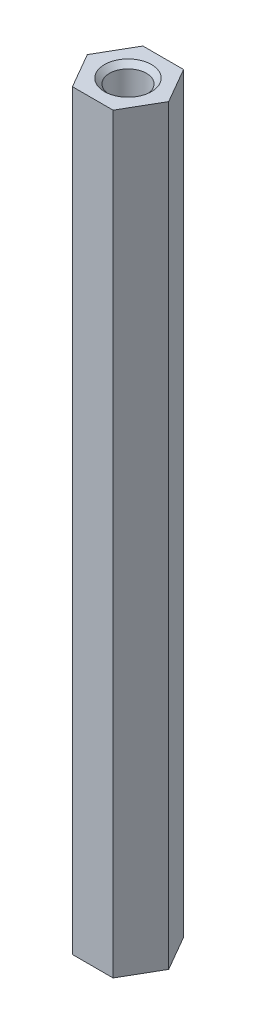
ISO-10303-21;
HEADER;
FILE_DESCRIPTION(('STEP AP214'),'2;1');
FILE_NAME('part.step','',(''),(''),'','','');
FILE_SCHEMA(('AUTOMOTIVE_DESIGN { 1 0 10303 214 1 1 1 1 }'));
ENDSEC;
DATA;
#1=APPLICATION_CONTEXT('core data for automotive mechanical design processes');
#2=APPLICATION_PROTOCOL_DEFINITION('international standard','automotive_design',2000,#1);
#3=PRODUCT_CONTEXT('',#1,'mechanical');
#4=PRODUCT('Part','Part','',(#3));
#5=PRODUCT_RELATED_PRODUCT_CATEGORY('part','',(#4));
#6=PRODUCT_DEFINITION_FORMATION('','',#4);
#7=PRODUCT_DEFINITION_CONTEXT('part definition',#1,'design');
#8=PRODUCT_DEFINITION('design','',#6,#7);
#9=PRODUCT_DEFINITION_SHAPE('','',#8);
#10=(LENGTH_UNIT() NAMED_UNIT(*) SI_UNIT(.MILLI.,.METRE.));
#11=(NAMED_UNIT(*) PLANE_ANGLE_UNIT() SI_UNIT($,.RADIAN.));
#12=(NAMED_UNIT(*) SI_UNIT($,.STERADIAN.) SOLID_ANGLE_UNIT());
#13=UNCERTAINTY_MEASURE_WITH_UNIT(LENGTH_MEASURE(1.E-05),#10,'distance_accuracy_value','');
#14=(GEOMETRIC_REPRESENTATION_CONTEXT(3) GLOBAL_UNCERTAINTY_ASSIGNED_CONTEXT((#13)) GLOBAL_UNIT_ASSIGNED_CONTEXT((#10,
#11,#12)) REPRESENTATION_CONTEXT('',''));
#15=CARTESIAN_POINT('',(0.,0.,0.));
#16=DIRECTION('',(0.,0.,1.));
#17=DIRECTION('',(1.,0.,0.));
#18=AXIS2_PLACEMENT_3D('',#15,#16,#17);
#19=CARTESIAN_POINT('',(0.866025403784438,32.,-1.5));
#20=DIRECTION('',(0.,0.,1.));
#21=DIRECTION('',(1.,0.,0.));
#22=AXIS2_PLACEMENT_3D('',#19,#20,#21);
#23=PLANE('',#22);
#24=DIRECTION('',(0.,1.,0.));
#25=VECTOR('',#24,1.);
#26=CARTESIAN_POINT('',(-0.866025403784439,32.,-1.5));
#27=LINE('',#26,#25);
#28=CARTESIAN_POINT('',(-0.866025403784438,0.,-1.5));
#29=VERTEX_POINT('',#28);
#30=CARTESIAN_POINT('',(-0.866025403784438,32.,-1.5));
#31=VERTEX_POINT('',#30);
#32=EDGE_CURVE('E83',#29,#31,#27,.T.);
#33=ORIENTED_EDGE('',*,*,#32,.T.);
#34=DIRECTION('',(1.,0.,0.));
#35=VECTOR('',#34,1.);
#36=CARTESIAN_POINT('',(0.866025403784438,32.,-1.5));
#37=LINE('',#36,#35);
#38=CARTESIAN_POINT('',(0.866025403784438,32.,-1.5));
#39=VERTEX_POINT('',#38);
#40=EDGE_CURVE('E71',#39,#31,#37,.F.);
#41=ORIENTED_EDGE('',*,*,#40,.F.);
#42=DIRECTION('',(0.,1.,0.));
#43=VECTOR('',#42,1.);
#44=CARTESIAN_POINT('',(0.866025403784438,32.,-1.5));
#45=LINE('',#44,#43);
#46=CARTESIAN_POINT('',(0.866025403784438,0.,-1.5));
#47=VERTEX_POINT('',#46);
#48=EDGE_CURVE('E126',#39,#47,#45,.F.);
#49=ORIENTED_EDGE('',*,*,#48,.T.);
#50=DIRECTION('',(1.,0.,0.));
#51=VECTOR('',#50,1.);
#52=CARTESIAN_POINT('',(0.866025403784438,0.,-1.5));
#53=LINE('',#52,#51);
#54=EDGE_CURVE('E67',#29,#47,#53,.T.);
#55=ORIENTED_EDGE('',*,*,#54,.F.);
#56=EDGE_LOOP('',(#33,#41,#49,#55));
#57=FACE_BOUND('',#56,.T.);
#58=ADVANCED_FACE('F17',(#57),#23,.F.);
#59=CARTESIAN_POINT('',(-0.866025403784439,32.,-1.5));
#60=DIRECTION('',(0.866025403784439,0.,0.5));
#61=DIRECTION('',(0.5,0.,-0.866025403784439));
#62=AXIS2_PLACEMENT_3D('',#59,#60,#61);
#63=PLANE('',#62);
#64=DIRECTION('',(0.,1.,0.));
#65=VECTOR('',#64,1.);
#66=CARTESIAN_POINT('',(-1.73205080756888,32.,0.));
#67=LINE('',#66,#65);
#68=CARTESIAN_POINT('',(-1.73205080756888,0.,0.));
#69=VERTEX_POINT('',#68);
#70=CARTESIAN_POINT('',(-1.73205080756888,32.,0.));
#71=VERTEX_POINT('',#70);
#72=EDGE_CURVE('E86',#69,#71,#67,.T.);
#73=ORIENTED_EDGE('',*,*,#72,.T.);
#74=DIRECTION('',(0.5,0.,-0.866025403784439));
#75=VECTOR('',#74,1.);
#76=CARTESIAN_POINT('',(-0.866025403784439,32.,-1.5));
#77=LINE('',#76,#75);
#78=EDGE_CURVE('E75',#31,#71,#77,.F.);
#79=ORIENTED_EDGE('',*,*,#78,.F.);
#80=ORIENTED_EDGE('',*,*,#32,.F.);
#81=DIRECTION('',(0.5,0.,-0.866025403784439));
#82=VECTOR('',#81,1.);
#83=CARTESIAN_POINT('',(-0.866025403784439,0.,-1.5));
#84=LINE('',#83,#82);
#85=EDGE_CURVE('E87',#69,#29,#84,.T.);
#86=ORIENTED_EDGE('',*,*,#85,.F.);
#87=EDGE_LOOP('',(#73,#79,#80,#86));
#88=FACE_BOUND('',#87,.T.);
#89=ADVANCED_FACE('F82',(#88),#63,.F.);
#90=CARTESIAN_POINT('',(1.7320508075689,32.,0.));
#91=DIRECTION('',(-0.866025403784434,0.,0.500000000000008));
#92=DIRECTION('',(0.500000000000008,0.,0.866025403784434));
#93=AXIS2_PLACEMENT_3D('',#90,#91,#92);
#94=PLANE('',#93);
#95=ORIENTED_EDGE('',*,*,#48,.F.);
#96=DIRECTION('',(0.500000000000008,0.,0.866025403784434));
#97=VECTOR('',#96,1.);
#98=CARTESIAN_POINT('',(1.7320508075689,32.,0.));
#99=LINE('',#98,#97);
#100=CARTESIAN_POINT('',(1.7320508075689,32.,0.));
#101=VERTEX_POINT('',#100);
#102=EDGE_CURVE('E77',#101,#39,#99,.F.);
#103=ORIENTED_EDGE('',*,*,#102,.F.);
#104=DIRECTION('',(0.,1.,0.));
#105=VECTOR('',#104,1.);
#106=CARTESIAN_POINT('',(1.7320508075689,32.,0.));
#107=LINE('',#106,#105);
#108=CARTESIAN_POINT('',(1.7320508075689,0.,0.));
#109=VERTEX_POINT('',#108);
#110=EDGE_CURVE('E113',#101,#109,#107,.F.);
#111=ORIENTED_EDGE('',*,*,#110,.T.);
#112=DIRECTION('',(0.500000000000008,0.,0.866025403784434));
#113=VECTOR('',#112,1.);
#114=CARTESIAN_POINT('',(1.7320508075689,0.,0.));
#115=LINE('',#114,#113);
#116=EDGE_CURVE('E124',#47,#109,#115,.T.);
#117=ORIENTED_EDGE('',*,*,#116,.F.);
#118=EDGE_LOOP('',(#95,#103,#111,#117));
#119=FACE_BOUND('',#118,.T.);
#120=ADVANCED_FACE('F143',(#119),#94,.F.);
#121=CARTESIAN_POINT('',(-1.73205080756888,32.,0.));
#122=DIRECTION('',(0.866025403784439,0.,-0.5));
#123=DIRECTION('',(-0.5,0.,-0.866025403784439));
#124=AXIS2_PLACEMENT_3D('',#121,#122,#123);
#125=PLANE('',#124);
#126=DIRECTION('',(0.,1.,0.));
#127=VECTOR('',#126,1.);
#128=CARTESIAN_POINT('',(-0.866025403784439,32.,1.5));
#129=LINE('',#128,#127);
#130=CARTESIAN_POINT('',(-0.866025403784439,0.,1.5));
#131=VERTEX_POINT('',#130);
#132=CARTESIAN_POINT('',(-0.866025403784439,32.,1.5));
#133=VERTEX_POINT('',#132);
#134=EDGE_CURVE('E112',#131,#133,#129,.T.);
#135=ORIENTED_EDGE('',*,*,#134,.T.);
#136=DIRECTION('',(-0.5,0.,-0.866025403784439));
#137=VECTOR('',#136,1.);
#138=CARTESIAN_POINT('',(-1.73205080756888,32.,0.));
#139=LINE('',#138,#137);
#140=EDGE_CURVE('E35',#71,#133,#139,.F.);
#141=ORIENTED_EDGE('',*,*,#140,.F.);
#142=ORIENTED_EDGE('',*,*,#72,.F.);
#143=DIRECTION('',(-0.5,0.,-0.866025403784439));
#144=VECTOR('',#143,1.);
#145=CARTESIAN_POINT('',(-1.73205080756888,0.,0.));
#146=LINE('',#145,#144);
#147=EDGE_CURVE('E119',#131,#69,#146,.T.);
#148=ORIENTED_EDGE('',*,*,#147,.F.);
#149=EDGE_LOOP('',(#135,#141,#142,#148));
#150=FACE_BOUND('',#149,.T.);
#151=ADVANCED_FACE('F133',(#150),#125,.F.);
#152=CARTESIAN_POINT('',(0.866025403784439,32.,1.5));
#153=DIRECTION('',(-0.866025403784432,0.,-0.500000000000011));
#154=DIRECTION('',(-0.500000000000011,0.,0.866025403784432));
#155=AXIS2_PLACEMENT_3D('',#152,#153,#154);
#156=PLANE('',#155);
#157=ORIENTED_EDGE('',*,*,#110,.F.);
#158=DIRECTION('',(-0.500000000000011,0.,0.866025403784432));
#159=VECTOR('',#158,1.);
#160=CARTESIAN_POINT('',(0.866025403784439,32.,1.5));
#161=LINE('',#160,#159);
#162=CARTESIAN_POINT('',(0.866025403784439,32.,1.5));
#163=VERTEX_POINT('',#162);
#164=EDGE_CURVE('E117',#163,#101,#161,.F.);
#165=ORIENTED_EDGE('',*,*,#164,.F.);
#166=DIRECTION('',(0.,1.,0.));
#167=VECTOR('',#166,1.);
#168=CARTESIAN_POINT('',(0.866025403784439,32.,1.5));
#169=LINE('',#168,#167);
#170=CARTESIAN_POINT('',(0.866025403784439,0.,1.5));
#171=VERTEX_POINT('',#170);
#172=EDGE_CURVE('E109',#163,#171,#169,.F.);
#173=ORIENTED_EDGE('',*,*,#172,.T.);
#174=DIRECTION('',(0.500000000000011,0.,-0.866025403784432));
#175=VECTOR('',#174,1.);
#176=CARTESIAN_POINT('',(0.866025403784439,0.,1.5));
#177=LINE('',#176,#175);
#178=EDGE_CURVE('E101',#171,#109,#177,.T.);
#179=ORIENTED_EDGE('',*,*,#178,.T.);
#180=EDGE_LOOP('',(#157,#165,#173,#179));
#181=FACE_BOUND('',#180,.T.);
#182=ADVANCED_FACE('F141',(#181),#156,.F.);
#183=CARTESIAN_POINT('',(-0.866025403784439,32.,1.5));
#184=DIRECTION('',(0.,0.,-1.));
#185=DIRECTION('',(-1.,0.,0.));
#186=AXIS2_PLACEMENT_3D('',#183,#184,#185);
#187=PLANE('',#186);
#188=ORIENTED_EDGE('',*,*,#172,.F.);
#189=DIRECTION('',(1.,0.,0.));
#190=VECTOR('',#189,1.);
#191=CARTESIAN_POINT('',(0.,32.,1.5));
#192=LINE('',#191,#190);
#193=EDGE_CURVE('E98',#133,#163,#192,.T.);
#194=ORIENTED_EDGE('',*,*,#193,.F.);
#195=ORIENTED_EDGE('',*,*,#134,.F.);
#196=DIRECTION('',(1.,0.,0.));
#197=VECTOR('',#196,1.);
#198=CARTESIAN_POINT('',(0.,0.,1.5));
#199=LINE('',#198,#197);
#200=EDGE_CURVE('E105',#131,#171,#199,.T.);
#201=ORIENTED_EDGE('',*,*,#200,.T.);
#202=EDGE_LOOP('',(#188,#194,#195,#201));
#203=FACE_BOUND('',#202,.T.);
#204=ADVANCED_FACE('F137',(#203),#187,.F.);
#205=CARTESIAN_POINT('',(0.,0.,0.));
#206=DIRECTION('',(0.,1.,0.));
#207=DIRECTION('',(0.,0.,1.));
#208=AXIS2_PLACEMENT_3D('',#205,#206,#207);
#209=PLANE('',#208);
#210=ORIENTED_EDGE('',*,*,#200,.F.);
#211=ORIENTED_EDGE('',*,*,#147,.T.);
#212=ORIENTED_EDGE('',*,*,#85,.T.);
#213=ORIENTED_EDGE('',*,*,#54,.T.);
#214=ORIENTED_EDGE('',*,*,#116,.T.);
#215=ORIENTED_EDGE('',*,*,#178,.F.);
#216=EDGE_LOOP('',(#210,#211,#212,#213,#214,#215));
#217=FACE_BOUND('',#216,.T.);
#218=CARTESIAN_POINT('',(0.,0.,0.));
#219=DIRECTION('',(0.,-1.,0.));
#220=DIRECTION('',(0.,0.,-1.));
#221=AXIS2_PLACEMENT_3D('',#218,#219,#220);
#222=CIRCLE('',#221,1.0000000000332);
#223=CARTESIAN_POINT('',(0.,0.,-1.0000000000332));
#224=VERTEX_POINT('',#223);
#225=EDGE_CURVE('E20',#224,#224,#222,.F.);
#226=ORIENTED_EDGE('',*,*,#225,.T.);
#227=EDGE_LOOP('',(#226));
#228=FACE_BOUND('',#227,.T.);
#229=ADVANCED_FACE('F130',(#217,#228),#209,.F.);
#230=CARTESIAN_POINT('',(0.,32.,0.));
#231=DIRECTION('',(0.,1.,0.));
#232=DIRECTION('',(0.,0.,1.));
#233=AXIS2_PLACEMENT_3D('',#230,#231,#232);
#234=PLANE('',#233);
#235=ORIENTED_EDGE('',*,*,#140,.T.);
#236=ORIENTED_EDGE('',*,*,#193,.T.);
#237=ORIENTED_EDGE('',*,*,#164,.T.);
#238=ORIENTED_EDGE('',*,*,#102,.T.);
#239=ORIENTED_EDGE('',*,*,#40,.T.);
#240=ORIENTED_EDGE('',*,*,#78,.T.);
#241=EDGE_LOOP('',(#235,#236,#237,#238,#239,#240));
#242=FACE_BOUND('',#241,.T.);
#243=CARTESIAN_POINT('',(0.,31.9999999999823,0.));
#244=DIRECTION('',(0.,1.,0.));
#245=DIRECTION('',(0.,0.,1.));
#246=AXIS2_PLACEMENT_3D('',#243,#244,#245);
#247=CIRCLE('',#246,1.0000000000332);
#248=CARTESIAN_POINT('',(0.,31.9999999999823,1.0000000000332));
#249=VERTEX_POINT('',#248);
#250=EDGE_CURVE('E92',#249,#249,#247,.F.);
#251=ORIENTED_EDGE('',*,*,#250,.T.);
#252=EDGE_LOOP('',(#251));
#253=FACE_BOUND('',#252,.T.);
#254=ADVANCED_FACE('F73',(#242,#253),#234,.T.);
#255=CARTESIAN_POINT('',(0.,1.13686837721616E-10,0.));
#256=DIRECTION('',(0.,-1.,0.));
#257=DIRECTION('',(0.,0.,-1.));
#258=AXIS2_PLACEMENT_3D('',#255,#256,#257);
#259=CONICAL_SURFACE('',#258,0.99999999991951,0.785398163397448);
#260=ORIENTED_EDGE('',*,*,#225,.F.);
#261=EDGE_LOOP('',(#260));
#262=FACE_BOUND('',#261,.T.);
#263=CARTESIAN_POINT('',(0.,0.215,0.));
#264=DIRECTION('',(0.,-1.,0.));
#265=DIRECTION('',(0.,0.,-1.));
#266=AXIS2_PLACEMENT_3D('',#263,#264,#265);
#267=CIRCLE('',#266,0.785);
#268=CARTESIAN_POINT('',(0.,0.215,-0.785));
#269=VERTEX_POINT('',#268);
#270=EDGE_CURVE('E26',#269,#269,#267,.F.);
#271=ORIENTED_EDGE('',*,*,#270,.T.);
#272=EDGE_LOOP('',(#271));
#273=FACE_BOUND('',#272,.T.);
#274=ADVANCED_FACE('F160',(#262,#273),#259,.F.);
#275=CARTESIAN_POINT('',(0.,31.9999999998686,0.));
#276=DIRECTION('',(0.,1.,0.));
#277=DIRECTION('',(0.,0.,1.));
#278=AXIS2_PLACEMENT_3D('',#275,#276,#277);
#279=CONICAL_SURFACE('',#278,0.99999999991951,0.785398163397448);
#280=CARTESIAN_POINT('',(0.,31.785,0.));
#281=DIRECTION('',(0.,-1.,0.));
#282=DIRECTION('',(0.,0.,-1.));
#283=AXIS2_PLACEMENT_3D('',#280,#281,#282);
#284=CIRCLE('',#283,0.785);
#285=CARTESIAN_POINT('',(0.,31.785,-0.785));
#286=VERTEX_POINT('',#285);
#287=EDGE_CURVE('E11',#286,#286,#284,.T.);
#288=ORIENTED_EDGE('',*,*,#287,.T.);
#289=EDGE_LOOP('',(#288));
#290=FACE_BOUND('',#289,.T.);
#291=ORIENTED_EDGE('',*,*,#250,.F.);
#292=EDGE_LOOP('',(#291));
#293=FACE_BOUND('',#292,.T.);
#294=ADVANCED_FACE('F154',(#290,#293),#279,.F.);
#295=CARTESIAN_POINT('',(0.,32.,0.));
#296=DIRECTION('',(0.,-1.,0.));
#297=DIRECTION('',(0.,0.,-1.));
#298=AXIS2_PLACEMENT_3D('',#295,#296,#297);
#299=CYLINDRICAL_SURFACE('',#298,0.785);
#300=ORIENTED_EDGE('',*,*,#270,.F.);
#301=EDGE_LOOP('',(#300));
#302=FACE_BOUND('',#301,.T.);
#303=ORIENTED_EDGE('',*,*,#287,.F.);
#304=EDGE_LOOP('',(#303));
#305=FACE_BOUND('',#304,.T.);
#306=ADVANCED_FACE('F152',(#302,#305),#299,.F.);
#307=CLOSED_SHELL('',(#58,#89,#120,#151,#182,#204,#229,#254,#274,#294,#306));
#308=MANIFOLD_SOLID_BREP('B1',#307);
#309=ADVANCED_BREP_SHAPE_REPRESENTATION('',(#18,#308),#14);
#310=SHAPE_DEFINITION_REPRESENTATION(#9,#309);
ENDSEC;
END-ISO-10303-21;
